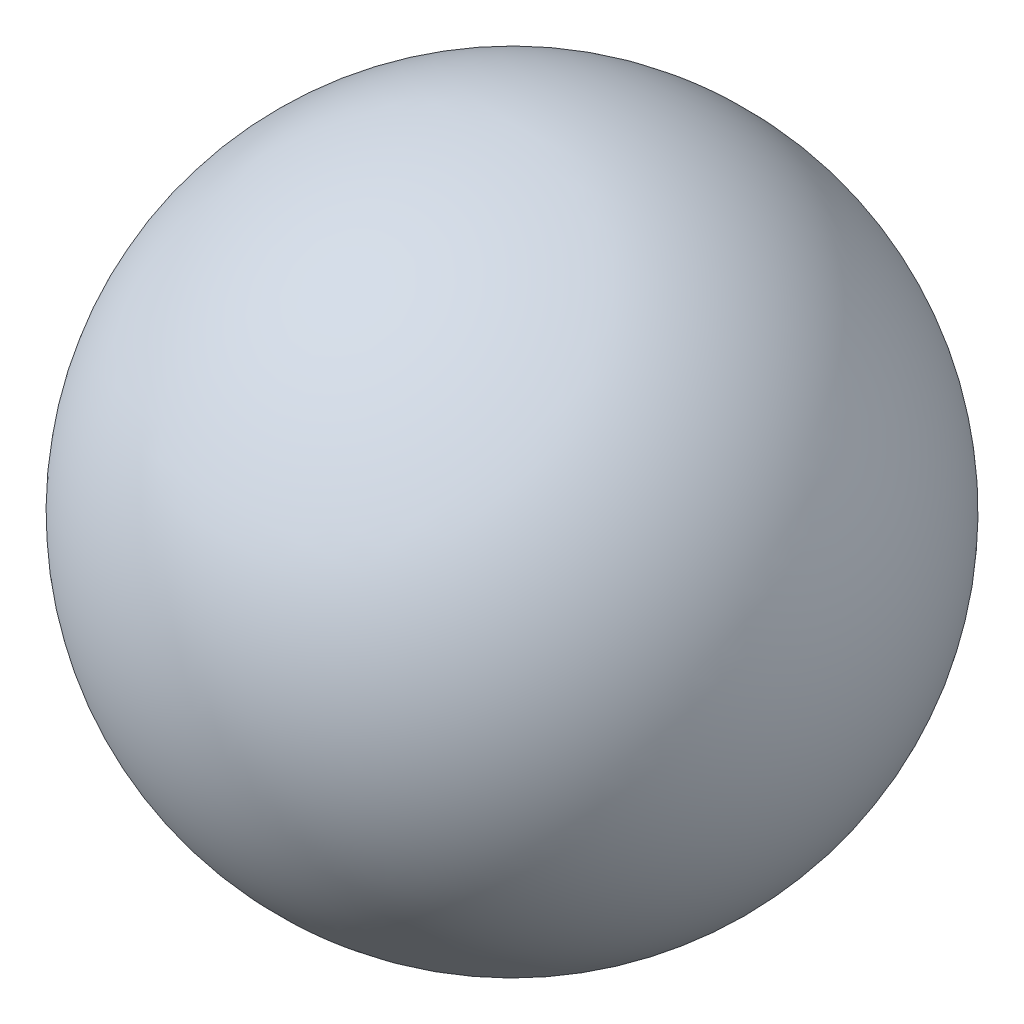
ISO-10303-21;
HEADER;
FILE_DESCRIPTION(('STEP AP214'),'2;1');
FILE_NAME('part.step','',(''),(''),'','','');
FILE_SCHEMA(('AUTOMOTIVE_DESIGN { 1 0 10303 214 1 1 1 1 }'));
ENDSEC;
DATA;
#1=APPLICATION_CONTEXT('core data for automotive mechanical design processes');
#2=APPLICATION_PROTOCOL_DEFINITION('international standard','automotive_design',2000,#1);
#3=PRODUCT_CONTEXT('',#1,'mechanical');
#4=PRODUCT('Part','Part','',(#3));
#5=PRODUCT_RELATED_PRODUCT_CATEGORY('part','',(#4));
#6=PRODUCT_DEFINITION_FORMATION('','',#4);
#7=PRODUCT_DEFINITION_CONTEXT('part definition',#1,'design');
#8=PRODUCT_DEFINITION('design','',#6,#7);
#9=PRODUCT_DEFINITION_SHAPE('','',#8);
#10=(LENGTH_UNIT() NAMED_UNIT(*) SI_UNIT(.MILLI.,.METRE.));
#11=(NAMED_UNIT(*) PLANE_ANGLE_UNIT() SI_UNIT($,.RADIAN.));
#12=(NAMED_UNIT(*) SI_UNIT($,.STERADIAN.) SOLID_ANGLE_UNIT());
#13=UNCERTAINTY_MEASURE_WITH_UNIT(LENGTH_MEASURE(1.E-05),#10,'distance_accuracy_value','');
#14=(GEOMETRIC_REPRESENTATION_CONTEXT(3) GLOBAL_UNCERTAINTY_ASSIGNED_CONTEXT((#13)) GLOBAL_UNIT_ASSIGNED_CONTEXT((#10,
#11,#12)) REPRESENTATION_CONTEXT('',''));
#15=CARTESIAN_POINT('',(0.,0.,0.));
#16=DIRECTION('',(0.,0.,1.));
#17=DIRECTION('',(1.,0.,0.));
#18=AXIS2_PLACEMENT_3D('',#15,#16,#17);
#19=CARTESIAN_POINT('',(49.75,-43.5640629643239,30.1847547329844));
#20=DIRECTION('',(0.,-0.821971206602399,0.569529047122793));
#21=DIRECTION('',(0.173648177666933,-0.560876621172181,-0.809483617014842));
#22=AXIS2_PLACEMENT_3D('',#19,#20,#21);
#23=SPHERICAL_SURFACE('',#22,5.95);
#24=CARTESIAN_POINT('',(49.75,-38.6733342850396,26.7960569026038));
#25=VERTEX_POINT('',#24);
#26=VERTEX_LOOP('',#25);
#27=FACE_BOUND('',#26,.T.);
#28=CARTESIAN_POINT('',(49.75,-48.4547916436082,33.573452563365));
#29=VERTEX_POINT('',#28);
#30=VERTEX_LOOP('',#29);
#31=FACE_BOUND('',#30,.T.);
#32=ADVANCED_FACE('F16',(#27,#31),#23,.T.);
#33=CLOSED_SHELL('',(#32));
#34=MANIFOLD_SOLID_BREP('B1',#33);
#35=ADVANCED_BREP_SHAPE_REPRESENTATION('',(#18,#34),#14);
#36=SHAPE_DEFINITION_REPRESENTATION(#9,#35);
ENDSEC;
END-ISO-10303-21;
